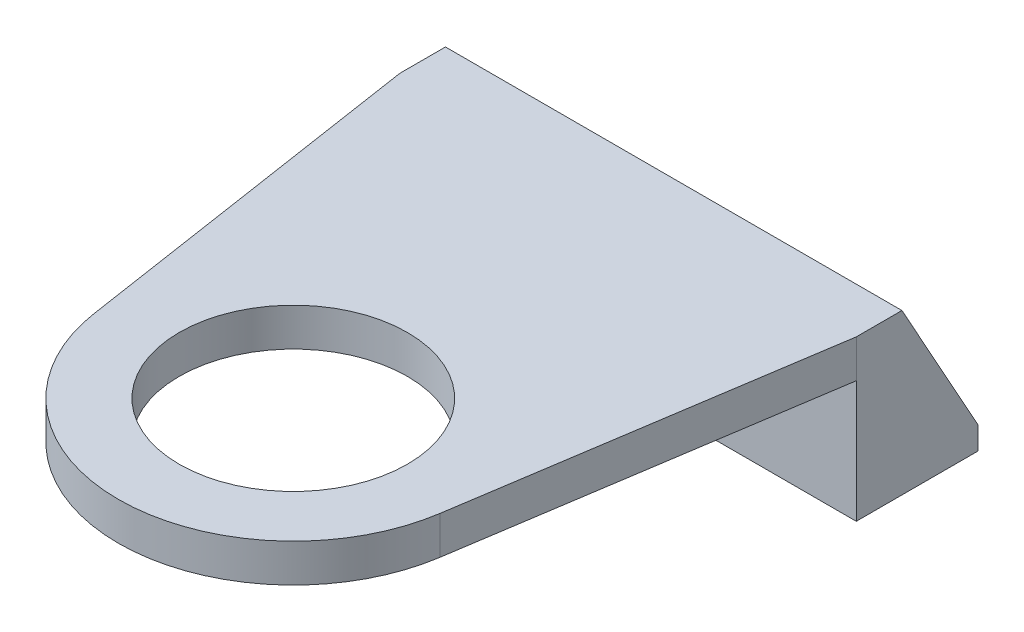
ISO-10303-21;
HEADER;
FILE_DESCRIPTION(('STEP AP214'),'2;1');
FILE_NAME('part.step','',(''),(''),'','','');
FILE_SCHEMA(('AUTOMOTIVE_DESIGN { 1 0 10303 214 1 1 1 1 }'));
ENDSEC;
DATA;
#1=APPLICATION_CONTEXT('core data for automotive mechanical design processes');
#2=APPLICATION_PROTOCOL_DEFINITION('international standard','automotive_design',2000,#1);
#3=PRODUCT_CONTEXT('',#1,'mechanical');
#4=PRODUCT('Part','Part','',(#3));
#5=PRODUCT_RELATED_PRODUCT_CATEGORY('part','',(#4));
#6=PRODUCT_DEFINITION_FORMATION('','',#4);
#7=PRODUCT_DEFINITION_CONTEXT('part definition',#1,'design');
#8=PRODUCT_DEFINITION('design','',#6,#7);
#9=PRODUCT_DEFINITION_SHAPE('','',#8);
#10=(LENGTH_UNIT() NAMED_UNIT(*) SI_UNIT(.MILLI.,.METRE.));
#11=(NAMED_UNIT(*) PLANE_ANGLE_UNIT() SI_UNIT($,.RADIAN.));
#12=(NAMED_UNIT(*) SI_UNIT($,.STERADIAN.) SOLID_ANGLE_UNIT());
#13=UNCERTAINTY_MEASURE_WITH_UNIT(LENGTH_MEASURE(1.E-05),#10,'distance_accuracy_value','');
#14=(GEOMETRIC_REPRESENTATION_CONTEXT(3) GLOBAL_UNCERTAINTY_ASSIGNED_CONTEXT((#13)) GLOBAL_UNIT_ASSIGNED_CONTEXT((#10,
#11,#12)) REPRESENTATION_CONTEXT('',''));
#15=CARTESIAN_POINT('',(0.,0.,0.));
#16=DIRECTION('',(0.,0.,1.));
#17=DIRECTION('',(1.,0.,0.));
#18=AXIS2_PLACEMENT_3D('',#15,#16,#17);
#19=CARTESIAN_POINT('',(-30.,3.,-8.));
#20=DIRECTION('',(1.,0.,0.));
#21=DIRECTION('',(0.,0.,-1.));
#22=AXIS2_PLACEMENT_3D('',#19,#20,#21);
#23=PLANE('',#22);
#24=DIRECTION('',(0.,1.,0.));
#25=VECTOR('',#24,1.);
#26=CARTESIAN_POINT('',(-30.,0.,8.));
#27=LINE('',#26,#25);
#28=CARTESIAN_POINT('',(-30.,16.,8.));
#29=VERTEX_POINT('',#28);
#30=CARTESIAN_POINT('',(-30.,21.,8.));
#31=VERTEX_POINT('',#30);
#32=EDGE_CURVE('E154',#29,#31,#27,.T.);
#33=ORIENTED_EDGE('',*,*,#32,.T.);
#34=DIRECTION('',(0.,0.,1.));
#35=VECTOR('',#34,1.);
#36=CARTESIAN_POINT('',(-30.,21.,8.));
#37=LINE('',#36,#35);
#38=CARTESIAN_POINT('',(-30.,21.,2.));
#39=VERTEX_POINT('',#38);
#40=EDGE_CURVE('E170',#39,#31,#37,.T.);
#41=ORIENTED_EDGE('',*,*,#40,.F.);
#42=DIRECTION('',(0.,0.874157276121538,0.485642931178632));
#43=VECTOR('',#42,1.);
#44=CARTESIAN_POINT('',(-30.,21.,2.));
#45=LINE('',#44,#43);
#46=CARTESIAN_POINT('',(-30.,3.,-8.));
#47=VERTEX_POINT('',#46);
#48=EDGE_CURVE('E197',#47,#39,#45,.T.);
#49=ORIENTED_EDGE('',*,*,#48,.F.);
#50=DIRECTION('',(0.,-1.,0.));
#51=VECTOR('',#50,1.);
#52=CARTESIAN_POINT('',(-30.,3.,-8.));
#53=LINE('',#52,#51);
#54=CARTESIAN_POINT('',(-30.,0.,-8.));
#55=VERTEX_POINT('',#54);
#56=EDGE_CURVE('E270',#47,#55,#53,.T.);
#57=ORIENTED_EDGE('',*,*,#56,.T.);
#58=DIRECTION('',(0.,0.,1.));
#59=VECTOR('',#58,1.);
#60=CARTESIAN_POINT('',(-30.,0.,-8.));
#61=LINE('',#60,#59);
#62=CARTESIAN_POINT('',(-30.,0.,8.));
#63=VERTEX_POINT('',#62);
#64=EDGE_CURVE('E261',#55,#63,#61,.T.);
#65=ORIENTED_EDGE('',*,*,#64,.T.);
#66=DIRECTION('',(0.,-1.,0.));
#67=VECTOR('',#66,1.);
#68=CARTESIAN_POINT('',(-30.,3.,8.));
#69=LINE('',#68,#67);
#70=EDGE_CURVE('E268',#29,#63,#69,.T.);
#71=ORIENTED_EDGE('',*,*,#70,.F.);
#72=EDGE_LOOP('',(#33,#41,#49,#57,#65,#71));
#73=FACE_BOUND('',#72,.T.);
#74=ADVANCED_FACE('F41',(#73),#23,.F.);
#75=CARTESIAN_POINT('',(0.,3.,0.));
#76=DIRECTION('',(0.,1.,0.));
#77=DIRECTION('',(0.,0.,1.));
#78=AXIS2_PLACEMENT_3D('',#75,#76,#77);
#79=PLANE('',#78);
#80=CARTESIAN_POINT('',(-15.,3.,-2.99999999999989));
#81=DIRECTION('',(0.,1.,0.));
#82=DIRECTION('',(0.,0.,1.));
#83=AXIS2_PLACEMENT_3D('',#80,#81,#82);
#84=CIRCLE('',#83,3.3);
#85=CARTESIAN_POINT('',(-15.,3.,0.300000000000109));
#86=VERTEX_POINT('',#85);
#87=EDGE_CURVE('E194',#86,#86,#84,.T.);
#88=ORIENTED_EDGE('',*,*,#87,.F.);
#89=EDGE_LOOP('',(#88));
#90=FACE_BOUND('',#89,.T.);
#91=DIRECTION('',(-1.,0.,0.));
#92=VECTOR('',#91,1.);
#93=CARTESIAN_POINT('',(-30.,3.,-8.));
#94=LINE('',#93,#92);
#95=CARTESIAN_POINT('',(-5.,3.,-8.));
#96=VERTEX_POINT('',#95);
#97=CARTESIAN_POINT('',(-24.,3.,-8.));
#98=VERTEX_POINT('',#97);
#99=EDGE_CURVE('E256',#96,#98,#94,.T.);
#100=ORIENTED_EDGE('',*,*,#99,.T.);
#101=DIRECTION('',(0.,0.,-1.));
#102=VECTOR('',#101,1.);
#103=CARTESIAN_POINT('',(-24.,3.,2.));
#104=LINE('',#103,#102);
#105=CARTESIAN_POINT('',(-24.,3.,2.));
#106=VERTEX_POINT('',#105);
#107=EDGE_CURVE('E202',#106,#98,#104,.T.);
#108=ORIENTED_EDGE('',*,*,#107,.F.);
#109=DIRECTION('',(-1.,0.,0.));
#110=VECTOR('',#109,1.);
#111=CARTESIAN_POINT('',(-30.,3.,2.));
#112=LINE('',#111,#110);
#113=CARTESIAN_POINT('',(-5.,3.,2.));
#114=VERTEX_POINT('',#113);
#115=EDGE_CURVE('E239',#114,#106,#112,.T.);
#116=ORIENTED_EDGE('',*,*,#115,.F.);
#117=DIRECTION('',(0.,0.,-1.));
#118=VECTOR('',#117,1.);
#119=CARTESIAN_POINT('',(-5.,3.,0.));
#120=LINE('',#119,#118);
#121=EDGE_CURVE('E225',#114,#96,#120,.T.);
#122=ORIENTED_EDGE('',*,*,#121,.T.);
#123=EDGE_LOOP('',(#100,#108,#116,#122));
#124=FACE_BOUND('',#123,.T.);
#125=ADVANCED_FACE('F320',(#90,#124),#79,.T.);
#126=CARTESIAN_POINT('',(-30.,21.,2.));
#127=DIRECTION('',(0.,0.,1.));
#128=DIRECTION('',(1.,0.,0.));
#129=AXIS2_PLACEMENT_3D('',#126,#127,#128);
#130=PLANE('',#129);
#131=DIRECTION('',(0.,-1.,0.));
#132=VECTOR('',#131,1.);
#133=CARTESIAN_POINT('',(-24.,21.,2.));
#134=LINE('',#133,#132);
#135=CARTESIAN_POINT('',(-24.,21.,2.));
#136=VERTEX_POINT('',#135);
#137=EDGE_CURVE('E198',#136,#106,#134,.T.);
#138=ORIENTED_EDGE('',*,*,#137,.F.);
#139=DIRECTION('',(-1.,0.,0.));
#140=VECTOR('',#139,1.);
#141=CARTESIAN_POINT('',(-30.,21.,2.));
#142=LINE('',#141,#140);
#143=CARTESIAN_POINT('',(-5.,21.,2.));
#144=VERTEX_POINT('',#143);
#145=EDGE_CURVE('E244',#144,#136,#142,.T.);
#146=ORIENTED_EDGE('',*,*,#145,.F.);
#147=DIRECTION('',(0.,1.,0.));
#148=VECTOR('',#147,1.);
#149=CARTESIAN_POINT('',(-5.,21.,2.));
#150=LINE('',#149,#148);
#151=EDGE_CURVE('E222',#114,#144,#150,.T.);
#152=ORIENTED_EDGE('',*,*,#151,.F.);
#153=ORIENTED_EDGE('',*,*,#115,.T.);
#154=EDGE_LOOP('',(#138,#146,#152,#153));
#155=FACE_BOUND('',#154,.T.);
#156=ADVANCED_FACE('F337',(#155),#130,.F.);
#157=CARTESIAN_POINT('',(15.,3.,-2.99999999999989));
#158=DIRECTION('',(0.,1.,0.));
#159=DIRECTION('',(0.,0.,1.));
#160=AXIS2_PLACEMENT_3D('',#157,#158,#159);
#161=CIRCLE('',#160,3.3);
#162=CARTESIAN_POINT('',(15.,3.,0.300000000000109));
#163=VERTEX_POINT('',#162);
#164=EDGE_CURVE('E185',#163,#163,#161,.T.);
#165=ORIENTED_EDGE('',*,*,#164,.F.);
#166=EDGE_LOOP('',(#165));
#167=FACE_BOUND('',#166,.T.);
#168=CARTESIAN_POINT('',(24.,3.,2.));
#169=VERTEX_POINT('',#168);
#170=CARTESIAN_POINT('',(5.,3.,2.));
#171=VERTEX_POINT('',#170);
#172=EDGE_CURVE('E242',#169,#171,#112,.T.);
#173=ORIENTED_EDGE('',*,*,#172,.F.);
#174=DIRECTION('',(0.,0.,-1.));
#175=VECTOR('',#174,1.);
#176=CARTESIAN_POINT('',(24.,3.,2.));
#177=LINE('',#176,#175);
#178=CARTESIAN_POINT('',(24.,3.,-8.));
#179=VERTEX_POINT('',#178);
#180=EDGE_CURVE('E213',#169,#179,#177,.T.);
#181=ORIENTED_EDGE('',*,*,#180,.T.);
#182=CARTESIAN_POINT('',(5.,3.,-8.));
#183=VERTEX_POINT('',#182);
#184=EDGE_CURVE('E255',#179,#183,#94,.T.);
#185=ORIENTED_EDGE('',*,*,#184,.T.);
#186=DIRECTION('',(0.,0.,-1.));
#187=VECTOR('',#186,1.);
#188=CARTESIAN_POINT('',(5.,3.,0.));
#189=LINE('',#188,#187);
#190=EDGE_CURVE('E231',#171,#183,#189,.T.);
#191=ORIENTED_EDGE('',*,*,#190,.F.);
#192=EDGE_LOOP('',(#173,#181,#185,#191));
#193=FACE_BOUND('',#192,.T.);
#194=ADVANCED_FACE('F315',(#167,#193),#79,.T.);
#195=DIRECTION('',(0.,-1.,0.));
#196=VECTOR('',#195,1.);
#197=CARTESIAN_POINT('',(24.,21.,2.));
#198=LINE('',#197,#196);
#199=CARTESIAN_POINT('',(24.,21.,2.));
#200=VERTEX_POINT('',#199);
#201=EDGE_CURVE('E210',#200,#169,#198,.T.);
#202=ORIENTED_EDGE('',*,*,#201,.T.);
#203=ORIENTED_EDGE('',*,*,#172,.T.);
#204=DIRECTION('',(0.,1.,0.));
#205=VECTOR('',#204,1.);
#206=CARTESIAN_POINT('',(5.,21.,2.));
#207=LINE('',#206,#205);
#208=CARTESIAN_POINT('',(5.,21.,2.));
#209=VERTEX_POINT('',#208);
#210=EDGE_CURVE('E228',#171,#209,#207,.T.);
#211=ORIENTED_EDGE('',*,*,#210,.T.);
#212=EDGE_CURVE('E249',#200,#209,#142,.T.);
#213=ORIENTED_EDGE('',*,*,#212,.F.);
#214=EDGE_LOOP('',(#202,#203,#211,#213));
#215=FACE_BOUND('',#214,.T.);
#216=ADVANCED_FACE('F312',(#215),#130,.F.);
#217=CARTESIAN_POINT('',(-30.,3.,8.));
#218=DIRECTION('',(0.,0.,-1.));
#219=DIRECTION('',(-1.,0.,0.));
#220=AXIS2_PLACEMENT_3D('',#217,#218,#219);
#221=PLANE('',#220);
#222=DIRECTION('',(0.,-1.,0.));
#223=VECTOR('',#222,1.);
#224=CARTESIAN_POINT('',(30.,3.,8.));
#225=LINE('',#224,#223);
#226=CARTESIAN_POINT('',(30.,16.,8.));
#227=VERTEX_POINT('',#226);
#228=CARTESIAN_POINT('',(30.,0.,8.));
#229=VERTEX_POINT('',#228);
#230=EDGE_CURVE('E254',#227,#229,#225,.T.);
#231=ORIENTED_EDGE('',*,*,#230,.F.);
#232=DIRECTION('',(1.,0.,0.));
#233=VECTOR('',#232,1.);
#234=CARTESIAN_POINT('',(-30.,16.,8.));
#235=LINE('',#234,#233);
#236=EDGE_CURVE('E236',#29,#227,#235,.T.);
#237=ORIENTED_EDGE('',*,*,#236,.F.);
#238=ORIENTED_EDGE('',*,*,#70,.T.);
#239=DIRECTION('',(1.,0.,0.));
#240=VECTOR('',#239,1.);
#241=CARTESIAN_POINT('',(-30.,0.,8.));
#242=LINE('',#241,#240);
#243=EDGE_CURVE('E264',#63,#229,#242,.T.);
#244=ORIENTED_EDGE('',*,*,#243,.T.);
#245=EDGE_LOOP('',(#231,#237,#238,#244));
#246=FACE_BOUND('',#245,.T.);
#247=ADVANCED_FACE('F286',(#246),#221,.F.);
#248=CARTESIAN_POINT('',(30.,3.,-8.));
#249=DIRECTION('',(-1.,0.,0.));
#250=DIRECTION('',(0.,0.,1.));
#251=AXIS2_PLACEMENT_3D('',#248,#249,#250);
#252=PLANE('',#251);
#253=DIRECTION('',(0.,0.,-1.));
#254=VECTOR('',#253,1.);
#255=CARTESIAN_POINT('',(30.,21.,8.));
#256=LINE('',#255,#254);
#257=CARTESIAN_POINT('',(30.,21.,8.));
#258=VERTEX_POINT('',#257);
#259=CARTESIAN_POINT('',(30.,21.,2.));
#260=VERTEX_POINT('',#259);
#261=EDGE_CURVE('E241',#258,#260,#256,.T.);
#262=ORIENTED_EDGE('',*,*,#261,.F.);
#263=DIRECTION('',(0.,1.,0.));
#264=VECTOR('',#263,1.);
#265=CARTESIAN_POINT('',(30.,0.,8.));
#266=LINE('',#265,#264);
#267=EDGE_CURVE('E177',#227,#258,#266,.T.);
#268=ORIENTED_EDGE('',*,*,#267,.F.);
#269=ORIENTED_EDGE('',*,*,#230,.T.);
#270=DIRECTION('',(0.,0.,-1.));
#271=VECTOR('',#270,1.);
#272=CARTESIAN_POINT('',(30.,0.,-8.));
#273=LINE('',#272,#271);
#274=CARTESIAN_POINT('',(30.,0.,-8.));
#275=VERTEX_POINT('',#274);
#276=EDGE_CURVE('E248',#229,#275,#273,.T.);
#277=ORIENTED_EDGE('',*,*,#276,.T.);
#278=DIRECTION('',(0.,-1.,0.));
#279=VECTOR('',#278,1.);
#280=CARTESIAN_POINT('',(30.,3.,-8.));
#281=LINE('',#280,#279);
#282=CARTESIAN_POINT('',(30.,3.,-8.));
#283=VERTEX_POINT('',#282);
#284=EDGE_CURVE('E273',#283,#275,#281,.T.);
#285=ORIENTED_EDGE('',*,*,#284,.F.);
#286=DIRECTION('',(0.,0.874157276121538,0.485642931178632));
#287=VECTOR('',#286,1.);
#288=CARTESIAN_POINT('',(30.,21.,2.));
#289=LINE('',#288,#287);
#290=EDGE_CURVE('E208',#283,#260,#289,.T.);
#291=ORIENTED_EDGE('',*,*,#290,.T.);
#292=EDGE_LOOP('',(#262,#268,#269,#277,#285,#291));
#293=FACE_BOUND('',#292,.T.);
#294=ADVANCED_FACE('F43',(#293),#252,.F.);
#295=CARTESIAN_POINT('',(-30.,3.,-8.));
#296=DIRECTION('',(0.,0.,1.));
#297=DIRECTION('',(1.,0.,0.));
#298=AXIS2_PLACEMENT_3D('',#295,#296,#297);
#299=PLANE('',#298);
#300=DIRECTION('',(-1.,0.,0.));
#301=VECTOR('',#300,1.);
#302=CARTESIAN_POINT('',(-30.,0.,-8.));
#303=LINE('',#302,#301);
#304=EDGE_CURVE('E259',#275,#55,#303,.T.);
#305=ORIENTED_EDGE('',*,*,#304,.T.);
#306=ORIENTED_EDGE('',*,*,#56,.F.);
#307=DIRECTION('',(-1.,0.,0.));
#308=VECTOR('',#307,1.);
#309=CARTESIAN_POINT('',(-24.,3.,-8.));
#310=LINE('',#309,#308);
#311=EDGE_CURVE('E206',#98,#47,#310,.T.);
#312=ORIENTED_EDGE('',*,*,#311,.F.);
#313=ORIENTED_EDGE('',*,*,#99,.F.);
#314=DIRECTION('',(1.,0.,0.));
#315=VECTOR('',#314,1.);
#316=CARTESIAN_POINT('',(0.,3.,-8.));
#317=LINE('',#316,#315);
#318=EDGE_CURVE('E234',#183,#96,#317,.F.);
#319=ORIENTED_EDGE('',*,*,#318,.F.);
#320=ORIENTED_EDGE('',*,*,#184,.F.);
#321=EDGE_CURVE('E252',#283,#179,#94,.T.);
#322=ORIENTED_EDGE('',*,*,#321,.F.);
#323=ORIENTED_EDGE('',*,*,#284,.T.);
#324=EDGE_LOOP('',(#305,#306,#312,#313,#319,#320,#322,#323));
#325=FACE_BOUND('',#324,.T.);
#326=ADVANCED_FACE('F298',(#325),#299,.F.);
#327=CARTESIAN_POINT('',(0.,0.,0.));
#328=DIRECTION('',(0.,1.,0.));
#329=DIRECTION('',(0.,0.,1.));
#330=AXIS2_PLACEMENT_3D('',#327,#328,#329);
#331=PLANE('',#330);
#332=CARTESIAN_POINT('',(15.,0.,-2.99999999999989));
#333=DIRECTION('',(0.,1.,0.));
#334=DIRECTION('',(0.,0.,1.));
#335=AXIS2_PLACEMENT_3D('',#332,#333,#334);
#336=CIRCLE('',#335,1.6);
#337=CARTESIAN_POINT('',(15.,0.,-1.39999999999989));
#338=VERTEX_POINT('',#337);
#339=EDGE_CURVE('E176',#338,#338,#336,.T.);
#340=ORIENTED_EDGE('',*,*,#339,.T.);
#341=EDGE_LOOP('',(#340));
#342=FACE_BOUND('',#341,.T.);
#343=CARTESIAN_POINT('',(-15.,0.,-2.99999999999989));
#344=DIRECTION('',(0.,1.,0.));
#345=DIRECTION('',(0.,0.,1.));
#346=AXIS2_PLACEMENT_3D('',#343,#344,#345);
#347=CIRCLE('',#346,1.6);
#348=CARTESIAN_POINT('',(-15.,0.,-1.39999999999989));
#349=VERTEX_POINT('',#348);
#350=EDGE_CURVE('E188',#349,#349,#347,.T.);
#351=ORIENTED_EDGE('',*,*,#350,.T.);
#352=EDGE_LOOP('',(#351));
#353=FACE_BOUND('',#352,.T.);
#354=ORIENTED_EDGE('',*,*,#276,.F.);
#355=ORIENTED_EDGE('',*,*,#243,.F.);
#356=ORIENTED_EDGE('',*,*,#64,.F.);
#357=ORIENTED_EDGE('',*,*,#304,.F.);
#358=EDGE_LOOP('',(#354,#355,#356,#357));
#359=FACE_BOUND('',#358,.T.);
#360=ADVANCED_FACE('F293',(#342,#353,#359),#331,.F.);
#361=CARTESIAN_POINT('',(0.,21.,0.));
#362=DIRECTION('',(0.,-1.,0.));
#363=DIRECTION('',(0.,0.,-1.));
#364=AXIS2_PLACEMENT_3D('',#361,#362,#363);
#365=PLANE('',#364);
#366=CARTESIAN_POINT('',(0.,21.,52.0000000000001));
#367=DIRECTION('',(0.,1.,0.));
#368=DIRECTION('',(0.,0.,1.));
#369=AXIS2_PLACEMENT_3D('',#366,#367,#368);
#370=CIRCLE('',#369,15.);
#371=CARTESIAN_POINT('',(0.,21.,67.0000000000001));
#372=VERTEX_POINT('',#371);
#373=EDGE_CURVE('E405',#372,#372,#370,.T.);
#374=ORIENTED_EDGE('',*,*,#373,.F.);
#375=EDGE_LOOP('',(#374));
#376=FACE_BOUND('',#375,.T.);
#377=CARTESIAN_POINT('',(0.,21.,52.0000000000001));
#378=DIRECTION('',(0.,1.,0.));
#379=DIRECTION('',(0.,0.,1.));
#380=AXIS2_PLACEMENT_3D('',#377,#378,#379);
#381=CIRCLE('',#380,23.);
#382=CARTESIAN_POINT('',(-22.7354071622357,21.,55.4786867015244));
#383=VERTEX_POINT('',#382);
#384=CARTESIAN_POINT('',(22.7354071622357,21.,55.4786867015244));
#385=VERTEX_POINT('',#384);
#386=EDGE_CURVE('E158',#383,#385,#381,.T.);
#387=ORIENTED_EDGE('',*,*,#386,.T.);
#388=DIRECTION('',(-0.151247247892362,0.,0.988495963575465));
#389=VECTOR('',#388,1.);
#390=CARTESIAN_POINT('',(30.5097864524976,21.,4.66822466126504));
#391=LINE('',#390,#389);
#392=EDGE_CURVE('E155',#258,#385,#391,.T.);
#393=ORIENTED_EDGE('',*,*,#392,.F.);
#394=ORIENTED_EDGE('',*,*,#261,.T.);
#395=EDGE_CURVE('E245',#260,#200,#142,.T.);
#396=ORIENTED_EDGE('',*,*,#395,.T.);
#397=ORIENTED_EDGE('',*,*,#212,.T.);
#398=EDGE_CURVE('E250',#209,#144,#142,.T.);
#399=ORIENTED_EDGE('',*,*,#398,.T.);
#400=ORIENTED_EDGE('',*,*,#145,.T.);
#401=DIRECTION('',(-1.,0.,0.));
#402=VECTOR('',#401,1.);
#403=CARTESIAN_POINT('',(-24.,21.,2.));
#404=LINE('',#403,#402);
#405=EDGE_CURVE('E204',#136,#39,#404,.T.);
#406=ORIENTED_EDGE('',*,*,#405,.T.);
#407=ORIENTED_EDGE('',*,*,#40,.T.);
#408=DIRECTION('',(0.151247247892362,0.,0.988495963575465));
#409=VECTOR('',#408,1.);
#410=CARTESIAN_POINT('',(-30.5097864524976,21.,4.66822466126504));
#411=LINE('',#410,#409);
#412=EDGE_CURVE('E148',#31,#383,#411,.T.);
#413=ORIENTED_EDGE('',*,*,#412,.T.);
#414=EDGE_LOOP('',(#387,#393,#394,#396,#397,#399,#400,#406,#407,#413));
#415=FACE_BOUND('',#414,.T.);
#416=ADVANCED_FACE('F167',(#376,#415),#365,.F.);
#417=CARTESIAN_POINT('',(-30.,16.,108.));
#418=DIRECTION('',(0.,1.,0.));
#419=DIRECTION('',(0.,0.,1.));
#420=AXIS2_PLACEMENT_3D('',#417,#418,#419);
#421=PLANE('',#420);
#422=CARTESIAN_POINT('',(0.,16.,52.0000000000001));
#423=DIRECTION('',(0.,1.,0.));
#424=DIRECTION('',(0.,0.,1.));
#425=AXIS2_PLACEMENT_3D('',#422,#423,#424);
#426=CIRCLE('',#425,15.);
#427=CARTESIAN_POINT('',(0.,16.,67.0000000000001));
#428=VERTEX_POINT('',#427);
#429=EDGE_CURVE('E45',#428,#428,#426,.T.);
#430=ORIENTED_EDGE('',*,*,#429,.T.);
#431=EDGE_LOOP('',(#430));
#432=FACE_BOUND('',#431,.T.);
#433=ORIENTED_EDGE('',*,*,#236,.T.);
#434=DIRECTION('',(-0.151247247892362,0.,0.988495963575465));
#435=VECTOR('',#434,1.);
#436=CARTESIAN_POINT('',(13.6767267959494,16.,114.682864643108));
#437=LINE('',#436,#435);
#438=CARTESIAN_POINT('',(22.7354071622357,16.,55.4786867015244));
#439=VERTEX_POINT('',#438);
#440=EDGE_CURVE('E11',#227,#439,#437,.T.);
#441=ORIENTED_EDGE('',*,*,#440,.T.);
#442=CARTESIAN_POINT('',(0.,16.,52.0000000000001));
#443=DIRECTION('',(0.,1.,0.));
#444=DIRECTION('',(0.,0.,1.));
#445=AXIS2_PLACEMENT_3D('',#442,#443,#444);
#446=CIRCLE('',#445,23.);
#447=CARTESIAN_POINT('',(-22.7354071622357,16.,55.4786867015244));
#448=VERTEX_POINT('',#447);
#449=EDGE_CURVE('E50',#448,#439,#446,.T.);
#450=ORIENTED_EDGE('',*,*,#449,.F.);
#451=DIRECTION('',(0.151247247892362,0.,0.988495963575465));
#452=VECTOR('',#451,1.);
#453=CARTESIAN_POINT('',(-15.0492705956502,16.,105.712427000499));
#454=LINE('',#453,#452);
#455=EDGE_CURVE('E151',#29,#448,#454,.T.);
#456=ORIENTED_EDGE('',*,*,#455,.F.);
#457=EDGE_LOOP('',(#433,#441,#450,#456));
#458=FACE_BOUND('',#457,.T.);
#459=ADVANCED_FACE('F281',(#432,#458),#421,.F.);
#460=CARTESIAN_POINT('',(0.,21.,2.));
#461=DIRECTION('',(0.,-0.485642931178632,0.874157276121538));
#462=DIRECTION('',(0.,-0.874157276121538,-0.485642931178632));
#463=AXIS2_PLACEMENT_3D('',#460,#461,#462);
#464=PLANE('',#463);
#465=DIRECTION('',(0.,-0.874157276121538,-0.485642931178632));
#466=VECTOR('',#465,1.);
#467=CARTESIAN_POINT('',(5.,21.,2.));
#468=LINE('',#467,#466);
#469=EDGE_CURVE('E219',#209,#183,#468,.T.);
#470=ORIENTED_EDGE('',*,*,#469,.T.);
#471=ORIENTED_EDGE('',*,*,#318,.T.);
#472=DIRECTION('',(0.,-0.874157276121538,-0.485642931178632));
#473=VECTOR('',#472,1.);
#474=CARTESIAN_POINT('',(-5.,21.,2.));
#475=LINE('',#474,#473);
#476=EDGE_CURVE('E65',#144,#96,#475,.T.);
#477=ORIENTED_EDGE('',*,*,#476,.F.);
#478=ORIENTED_EDGE('',*,*,#398,.F.);
#479=EDGE_LOOP('',(#470,#471,#477,#478));
#480=FACE_BOUND('',#479,.T.);
#481=ADVANCED_FACE('F306',(#480),#464,.F.);
#482=CARTESIAN_POINT('',(5.,10.5,50.));
#483=DIRECTION('',(1.,0.,0.));
#484=DIRECTION('',(0.,0.,-1.));
#485=AXIS2_PLACEMENT_3D('',#482,#483,#484);
#486=PLANE('',#485);
#487=ORIENTED_EDGE('',*,*,#210,.F.);
#488=ORIENTED_EDGE('',*,*,#190,.T.);
#489=ORIENTED_EDGE('',*,*,#469,.F.);
#490=EDGE_LOOP('',(#487,#488,#489));
#491=FACE_BOUND('',#490,.T.);
#492=ADVANCED_FACE('F310',(#491),#486,.T.);
#493=CARTESIAN_POINT('',(-5.,10.5,50.));
#494=DIRECTION('',(1.,0.,0.));
#495=DIRECTION('',(0.,0.,-1.));
#496=AXIS2_PLACEMENT_3D('',#493,#494,#495);
#497=PLANE('',#496);
#498=ORIENTED_EDGE('',*,*,#121,.F.);
#499=ORIENTED_EDGE('',*,*,#151,.T.);
#500=ORIENTED_EDGE('',*,*,#476,.T.);
#501=EDGE_LOOP('',(#498,#499,#500));
#502=FACE_BOUND('',#501,.T.);
#503=ADVANCED_FACE('F389',(#502),#497,.F.);
#504=CARTESIAN_POINT('',(24.,21.,2.));
#505=DIRECTION('',(0.,0.485642931178632,-0.874157276121538));
#506=DIRECTION('',(0.,0.874157276121538,0.485642931178632));
#507=AXIS2_PLACEMENT_3D('',#504,#505,#506);
#508=PLANE('',#507);
#509=ORIENTED_EDGE('',*,*,#290,.F.);
#510=ORIENTED_EDGE('',*,*,#321,.T.);
#511=DIRECTION('',(0.,0.874157276121538,0.485642931178632));
#512=VECTOR('',#511,1.);
#513=CARTESIAN_POINT('',(24.,21.,2.));
#514=LINE('',#513,#512);
#515=EDGE_CURVE('E57',#179,#200,#514,.T.);
#516=ORIENTED_EDGE('',*,*,#515,.T.);
#517=ORIENTED_EDGE('',*,*,#395,.F.);
#518=EDGE_LOOP('',(#509,#510,#516,#517));
#519=FACE_BOUND('',#518,.T.);
#520=ADVANCED_FACE('F300',(#519),#508,.T.);
#521=CARTESIAN_POINT('',(24.,0.,0.));
#522=DIRECTION('',(1.,0.,0.));
#523=DIRECTION('',(0.,0.,-1.));
#524=AXIS2_PLACEMENT_3D('',#521,#522,#523);
#525=PLANE('',#524);
#526=ORIENTED_EDGE('',*,*,#201,.F.);
#527=ORIENTED_EDGE('',*,*,#515,.F.);
#528=ORIENTED_EDGE('',*,*,#180,.F.);
#529=EDGE_LOOP('',(#526,#527,#528));
#530=FACE_BOUND('',#529,.T.);
#531=ADVANCED_FACE('F382',(#530),#525,.F.);
#532=CARTESIAN_POINT('',(-24.,21.,2.));
#533=DIRECTION('',(0.,-0.485642931178632,0.874157276121538));
#534=DIRECTION('',(0.,-0.874157276121538,-0.485642931178632));
#535=AXIS2_PLACEMENT_3D('',#532,#533,#534);
#536=PLANE('',#535);
#537=ORIENTED_EDGE('',*,*,#48,.T.);
#538=ORIENTED_EDGE('',*,*,#405,.F.);
#539=DIRECTION('',(0.,0.874157276121538,0.485642931178632));
#540=VECTOR('',#539,1.);
#541=CARTESIAN_POINT('',(-24.,21.,2.));
#542=LINE('',#541,#540);
#543=EDGE_CURVE('E200',#98,#136,#542,.T.);
#544=ORIENTED_EDGE('',*,*,#543,.F.);
#545=ORIENTED_EDGE('',*,*,#311,.T.);
#546=EDGE_LOOP('',(#537,#538,#544,#545));
#547=FACE_BOUND('',#546,.T.);
#548=ADVANCED_FACE('F327',(#547),#536,.F.);
#549=CARTESIAN_POINT('',(-24.,0.,0.));
#550=DIRECTION('',(-1.,0.,0.));
#551=DIRECTION('',(0.,0.,-1.));
#552=AXIS2_PLACEMENT_3D('',#549,#550,#551);
#553=PLANE('',#552);
#554=ORIENTED_EDGE('',*,*,#137,.T.);
#555=ORIENTED_EDGE('',*,*,#107,.T.);
#556=ORIENTED_EDGE('',*,*,#543,.T.);
#557=EDGE_LOOP('',(#554,#555,#556));
#558=FACE_BOUND('',#557,.T.);
#559=ADVANCED_FACE('F372',(#558),#553,.F.);
#560=CARTESIAN_POINT('',(-15.,3.,-2.99999999999989));
#561=DIRECTION('',(0.,1.,0.));
#562=DIRECTION('',(0.,0.,1.));
#563=AXIS2_PLACEMENT_3D('',#560,#561,#562);
#564=CONICAL_SURFACE('',#563,3.3,0.785398163397448);
#565=CARTESIAN_POINT('',(-15.,1.3,-2.99999999999989));
#566=DIRECTION('',(0.,1.,0.));
#567=DIRECTION('',(0.,0.,1.));
#568=AXIS2_PLACEMENT_3D('',#565,#566,#567);
#569=CIRCLE('',#568,1.6);
#570=CARTESIAN_POINT('',(-15.,1.3,-1.39999999999989));
#571=VERTEX_POINT('',#570);
#572=EDGE_CURVE('E191',#571,#571,#569,.T.);
#573=ORIENTED_EDGE('',*,*,#572,.F.);
#574=EDGE_LOOP('',(#573));
#575=FACE_BOUND('',#574,.T.);
#576=ORIENTED_EDGE('',*,*,#87,.T.);
#577=EDGE_LOOP('',(#576));
#578=FACE_BOUND('',#577,.T.);
#579=ADVANCED_FACE('F374',(#575,#578),#564,.F.);
#580=CARTESIAN_POINT('',(-15.,3.,-2.99999999999989));
#581=DIRECTION('',(0.,1.,0.));
#582=DIRECTION('',(0.,0.,1.));
#583=AXIS2_PLACEMENT_3D('',#580,#581,#582);
#584=CYLINDRICAL_SURFACE('',#583,1.6);
#585=ORIENTED_EDGE('',*,*,#350,.F.);
#586=EDGE_LOOP('',(#585));
#587=FACE_BOUND('',#586,.T.);
#588=ORIENTED_EDGE('',*,*,#572,.T.);
#589=EDGE_LOOP('',(#588));
#590=FACE_BOUND('',#589,.T.);
#591=ADVANCED_FACE('F379',(#587,#590),#584,.F.);
#592=CARTESIAN_POINT('',(15.,3.,-2.99999999999989));
#593=DIRECTION('',(0.,1.,0.));
#594=DIRECTION('',(0.,0.,1.));
#595=AXIS2_PLACEMENT_3D('',#592,#593,#594);
#596=CONICAL_SURFACE('',#595,3.3,0.785398163397448);
#597=CARTESIAN_POINT('',(15.,1.3,-2.99999999999989));
#598=DIRECTION('',(0.,1.,0.));
#599=DIRECTION('',(0.,0.,1.));
#600=AXIS2_PLACEMENT_3D('',#597,#598,#599);
#601=CIRCLE('',#600,1.6);
#602=CARTESIAN_POINT('',(15.,1.3,-1.39999999999989));
#603=VERTEX_POINT('',#602);
#604=EDGE_CURVE('E182',#603,#603,#601,.T.);
#605=ORIENTED_EDGE('',*,*,#604,.F.);
#606=EDGE_LOOP('',(#605));
#607=FACE_BOUND('',#606,.T.);
#608=ORIENTED_EDGE('',*,*,#164,.T.);
#609=EDGE_LOOP('',(#608));
#610=FACE_BOUND('',#609,.T.);
#611=ADVANCED_FACE('F422',(#607,#610),#596,.F.);
#612=CARTESIAN_POINT('',(15.,3.,-2.99999999999989));
#613=DIRECTION('',(0.,1.,0.));
#614=DIRECTION('',(0.,0.,1.));
#615=AXIS2_PLACEMENT_3D('',#612,#613,#614);
#616=CYLINDRICAL_SURFACE('',#615,1.6);
#617=ORIENTED_EDGE('',*,*,#339,.F.);
#618=EDGE_LOOP('',(#617));
#619=FACE_BOUND('',#618,.T.);
#620=ORIENTED_EDGE('',*,*,#604,.T.);
#621=EDGE_LOOP('',(#620));
#622=FACE_BOUND('',#621,.T.);
#623=ADVANCED_FACE('F420',(#619,#622),#616,.F.);
#624=CARTESIAN_POINT('',(0.,0.,52.0000000000001));
#625=DIRECTION('',(0.,1.,0.));
#626=DIRECTION('',(0.,0.,1.));
#627=AXIS2_PLACEMENT_3D('',#624,#625,#626);
#628=CYLINDRICAL_SURFACE('',#627,23.);
#629=ORIENTED_EDGE('',*,*,#449,.T.);
#630=DIRECTION('',(0.,1.,0.));
#631=VECTOR('',#630,1.);
#632=CARTESIAN_POINT('',(22.7354071622357,0.,55.4786867015244));
#633=LINE('',#632,#631);
#634=EDGE_CURVE('E161',#439,#385,#633,.T.);
#635=ORIENTED_EDGE('',*,*,#634,.T.);
#636=ORIENTED_EDGE('',*,*,#386,.F.);
#637=DIRECTION('',(0.,1.,0.));
#638=VECTOR('',#637,1.);
#639=CARTESIAN_POINT('',(-22.7354071622357,0.,55.4786867015244));
#640=LINE('',#639,#638);
#641=EDGE_CURVE('E144',#448,#383,#640,.T.);
#642=ORIENTED_EDGE('',*,*,#641,.F.);
#643=EDGE_LOOP('',(#629,#635,#636,#642));
#644=FACE_BOUND('',#643,.T.);
#645=ADVANCED_FACE('F159',(#644),#628,.T.);
#646=CARTESIAN_POINT('',(30.5097864524976,0.,4.66822466126504));
#647=DIRECTION('',(-0.988495963575465,0.,-0.151247247892362));
#648=DIRECTION('',(-0.151247247892362,0.,0.988495963575465));
#649=AXIS2_PLACEMENT_3D('',#646,#647,#648);
#650=PLANE('',#649);
#651=ORIENTED_EDGE('',*,*,#267,.T.);
#652=ORIENTED_EDGE('',*,*,#392,.T.);
#653=ORIENTED_EDGE('',*,*,#634,.F.);
#654=ORIENTED_EDGE('',*,*,#440,.F.);
#655=EDGE_LOOP('',(#651,#652,#653,#654));
#656=FACE_BOUND('',#655,.T.);
#657=ADVANCED_FACE('F279',(#656),#650,.F.);
#658=CARTESIAN_POINT('',(-30.5097864524976,0.,4.66822466126504));
#659=DIRECTION('',(-0.988495963575465,0.,0.151247247892362));
#660=DIRECTION('',(0.151247247892362,0.,0.988495963575465));
#661=AXIS2_PLACEMENT_3D('',#658,#659,#660);
#662=PLANE('',#661);
#663=ORIENTED_EDGE('',*,*,#455,.T.);
#664=ORIENTED_EDGE('',*,*,#641,.T.);
#665=ORIENTED_EDGE('',*,*,#412,.F.);
#666=ORIENTED_EDGE('',*,*,#32,.F.);
#667=EDGE_LOOP('',(#663,#664,#665,#666));
#668=FACE_BOUND('',#667,.T.);
#669=ADVANCED_FACE('F146',(#668),#662,.T.);
#670=CARTESIAN_POINT('',(0.,0.,52.0000000000001));
#671=DIRECTION('',(0.,1.,0.));
#672=DIRECTION('',(0.,0.,1.));
#673=AXIS2_PLACEMENT_3D('',#670,#671,#672);
#674=CYLINDRICAL_SURFACE('',#673,15.);
#675=ORIENTED_EDGE('',*,*,#373,.T.);
#676=EDGE_LOOP('',(#675));
#677=FACE_BOUND('',#676,.T.);
#678=ORIENTED_EDGE('',*,*,#429,.F.);
#679=EDGE_LOOP('',(#678));
#680=FACE_BOUND('',#679,.T.);
#681=ADVANCED_FACE('F410',(#677,#680),#674,.F.);
#682=CLOSED_SHELL('',(#74,#125,#156,#194,#216,#247,#294,#326,#360,#416,#459,#481,#492,#503,#520,
#531,#548,#559,#579,#591,#611,#623,#645,#657,#669,#681));
#683=MANIFOLD_SOLID_BREP('B2',#682);
#684=ADVANCED_BREP_SHAPE_REPRESENTATION('',(#18,#683),#14);
#685=SHAPE_DEFINITION_REPRESENTATION(#9,#684);
ENDSEC;
END-ISO-10303-21;
